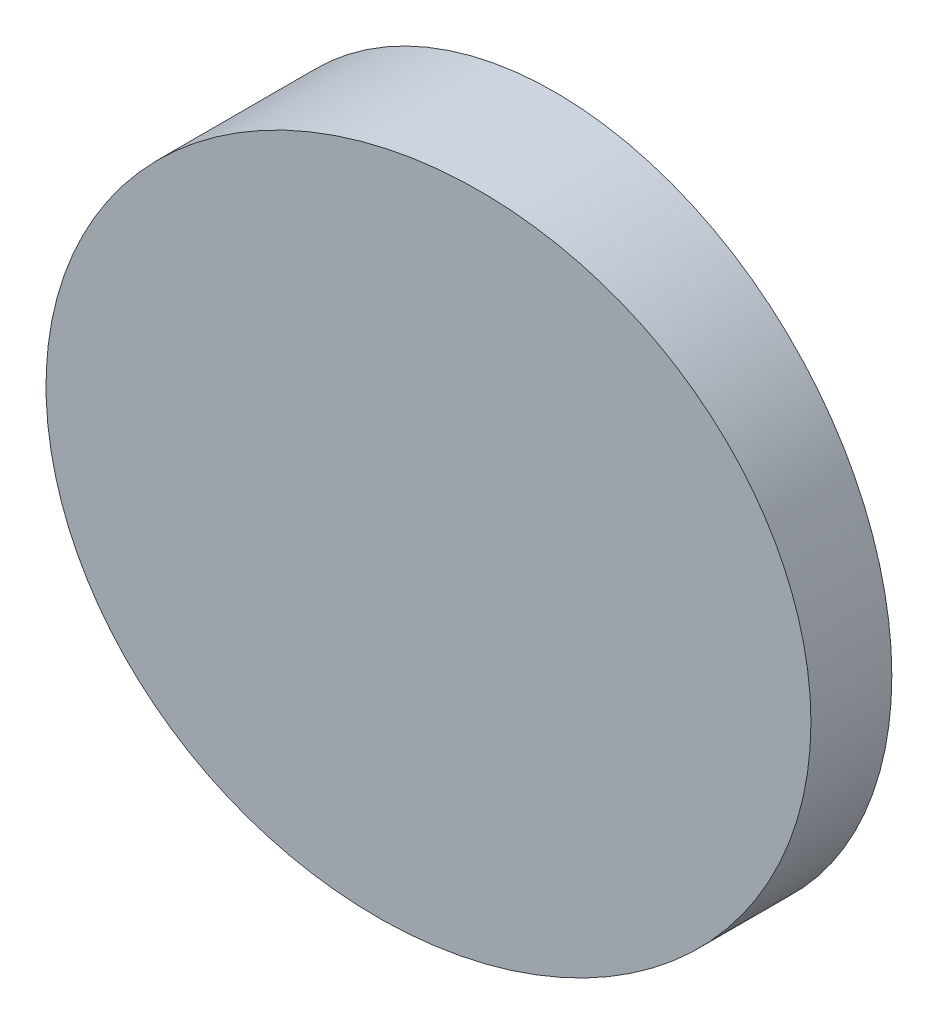
ISO-10303-21;
HEADER;
FILE_DESCRIPTION(('STEP AP214'),'2;1');
FILE_NAME('part.step','',(''),(''),'','','');
FILE_SCHEMA(('AUTOMOTIVE_DESIGN { 1 0 10303 214 1 1 1 1 }'));
ENDSEC;
DATA;
#1=APPLICATION_CONTEXT('core data for automotive mechanical design processes');
#2=APPLICATION_PROTOCOL_DEFINITION('international standard','automotive_design',2000,#1);
#3=PRODUCT_CONTEXT('',#1,'mechanical');
#4=PRODUCT('Part','Part','',(#3));
#5=PRODUCT_RELATED_PRODUCT_CATEGORY('part','',(#4));
#6=PRODUCT_DEFINITION_FORMATION('','',#4);
#7=PRODUCT_DEFINITION_CONTEXT('part definition',#1,'design');
#8=PRODUCT_DEFINITION('design','',#6,#7);
#9=PRODUCT_DEFINITION_SHAPE('','',#8);
#10=(LENGTH_UNIT() NAMED_UNIT(*) SI_UNIT(.MILLI.,.METRE.));
#11=(NAMED_UNIT(*) PLANE_ANGLE_UNIT() SI_UNIT($,.RADIAN.));
#12=(NAMED_UNIT(*) SI_UNIT($,.STERADIAN.) SOLID_ANGLE_UNIT());
#13=UNCERTAINTY_MEASURE_WITH_UNIT(LENGTH_MEASURE(1.E-05),#10,'distance_accuracy_value','');
#14=(GEOMETRIC_REPRESENTATION_CONTEXT(3) GLOBAL_UNCERTAINTY_ASSIGNED_CONTEXT((#13)) GLOBAL_UNIT_ASSIGNED_CONTEXT((#10,
#11,#12)) REPRESENTATION_CONTEXT('',''));
#15=CARTESIAN_POINT('',(0.,0.,0.));
#16=DIRECTION('',(0.,0.,1.));
#17=DIRECTION('',(1.,0.,0.));
#18=AXIS2_PLACEMENT_3D('',#15,#16,#17);
#19=CARTESIAN_POINT('',(0.,0.,10.));
#20=DIRECTION('',(0.,0.,-1.));
#21=DIRECTION('',(-1.,0.,0.));
#22=AXIS2_PLACEMENT_3D('',#19,#20,#21);
#23=CYLINDRICAL_SURFACE('',#22,12.5);
#24=CARTESIAN_POINT('',(0.,0.,4.68562343085428));
#25=DIRECTION('',(-0.133640258869073,0.,-0.991029909341493));
#26=DIRECTION('',(0.991029909341493,0.,-0.133640258869073));
#27=AXIS2_PLACEMENT_3D('',#24,#25,#26);
#28=ELLIPSE('',#27,12.6131410184238,12.5);
#29=CARTESIAN_POINT('',(12.5,0.,3.));
#30=VERTEX_POINT('',#29);
#31=EDGE_CURVE('E34',#30,#30,#28,.T.);
#32=ORIENTED_EDGE('',*,*,#31,.T.);
#33=EDGE_LOOP('',(#32));
#34=FACE_BOUND('',#33,.T.);
#35=CARTESIAN_POINT('',(0.,0.,0.));
#36=DIRECTION('',(0.,0.,1.));
#37=DIRECTION('',(1.,0.,0.));
#38=AXIS2_PLACEMENT_3D('',#35,#36,#37);
#39=CIRCLE('',#38,12.5);
#40=CARTESIAN_POINT('',(12.5,0.,0.));
#41=VERTEX_POINT('',#40);
#42=EDGE_CURVE('E10',#41,#41,#39,.T.);
#43=ORIENTED_EDGE('',*,*,#42,.T.);
#44=EDGE_LOOP('',(#43));
#45=FACE_BOUND('',#44,.T.);
#46=ADVANCED_FACE('F31',(#34,#45),#23,.T.);
#47=CARTESIAN_POINT('',(0.,0.,0.));
#48=DIRECTION('',(0.,0.,1.));
#49=DIRECTION('',(1.,0.,0.));
#50=AXIS2_PLACEMENT_3D('',#47,#48,#49);
#51=PLANE('',#50);
#52=ORIENTED_EDGE('',*,*,#42,.F.);
#53=EDGE_LOOP('',(#52));
#54=FACE_BOUND('',#53,.T.);
#55=ADVANCED_FACE('F46',(#54),#51,.F.);
#56=CARTESIAN_POINT('',(12.5,-25.,3.));
#57=DIRECTION('',(-0.133640258869073,0.,-0.991029909341493));
#58=DIRECTION('',(-0.991029909341493,0.,0.133640258869073));
#59=AXIS2_PLACEMENT_3D('',#56,#57,#58);
#60=PLANE('',#59);
#61=ORIENTED_EDGE('',*,*,#31,.F.);
#62=EDGE_LOOP('',(#61));
#63=FACE_BOUND('',#62,.T.);
#64=ADVANCED_FACE('F44',(#63),#60,.F.);
#65=CLOSED_SHELL('',(#46,#55,#64));
#66=MANIFOLD_SOLID_BREP('B2',#65);
#67=ADVANCED_BREP_SHAPE_REPRESENTATION('',(#18,#66),#14);
#68=SHAPE_DEFINITION_REPRESENTATION(#9,#67);
ENDSEC;
END-ISO-10303-21;
